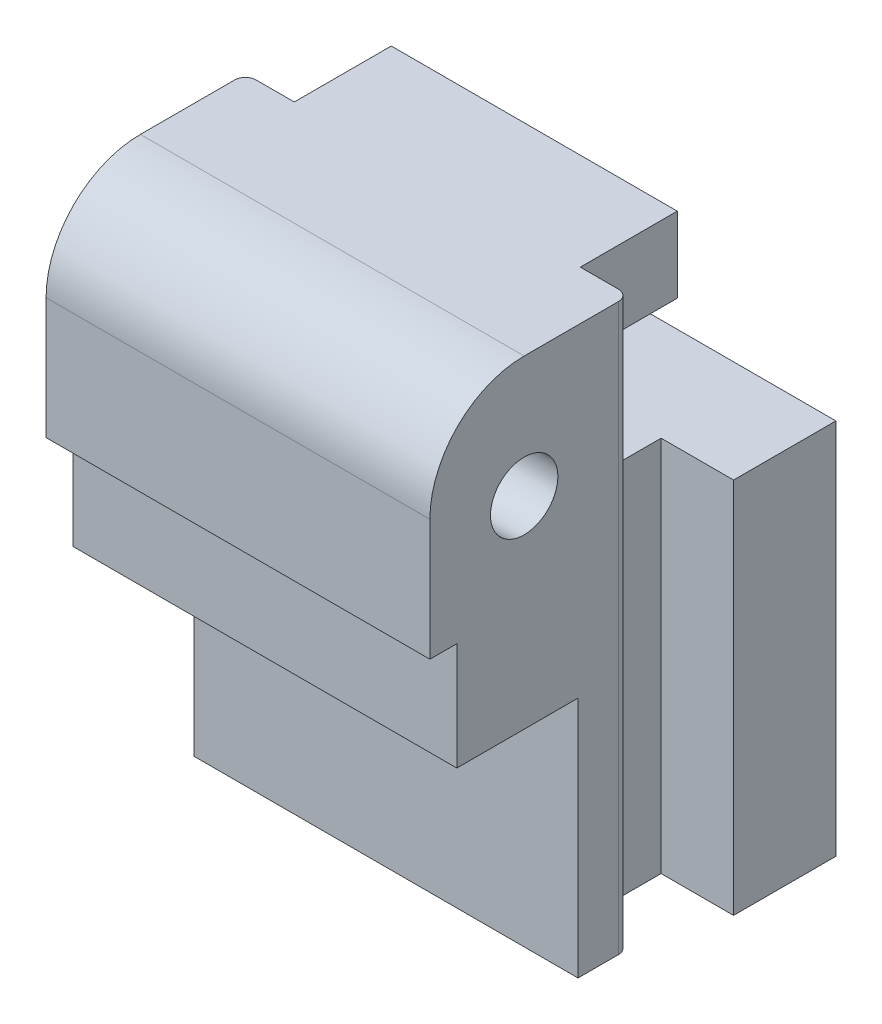
ISO-10303-21;
HEADER;
FILE_DESCRIPTION(('STEP AP214'),'2;1');
FILE_NAME('part.step','',(''),(''),'','','');
FILE_SCHEMA(('AUTOMOTIVE_DESIGN { 1 0 10303 214 1 1 1 1 }'));
ENDSEC;
DATA;
#1=APPLICATION_CONTEXT('core data for automotive mechanical design processes');
#2=APPLICATION_PROTOCOL_DEFINITION('international standard','automotive_design',2000,#1);
#3=PRODUCT_CONTEXT('',#1,'mechanical');
#4=PRODUCT('Part','Part','',(#3));
#5=PRODUCT_RELATED_PRODUCT_CATEGORY('part','',(#4));
#6=PRODUCT_DEFINITION_FORMATION('','',#4);
#7=PRODUCT_DEFINITION_CONTEXT('part definition',#1,'design');
#8=PRODUCT_DEFINITION('design','',#6,#7);
#9=PRODUCT_DEFINITION_SHAPE('','',#8);
#10=(LENGTH_UNIT() NAMED_UNIT(*) SI_UNIT(.MILLI.,.METRE.));
#11=(NAMED_UNIT(*) PLANE_ANGLE_UNIT() SI_UNIT($,.RADIAN.));
#12=(NAMED_UNIT(*) SI_UNIT($,.STERADIAN.) SOLID_ANGLE_UNIT());
#13=UNCERTAINTY_MEASURE_WITH_UNIT(LENGTH_MEASURE(1.E-05),#10,'distance_accuracy_value','');
#14=(GEOMETRIC_REPRESENTATION_CONTEXT(3) GLOBAL_UNCERTAINTY_ASSIGNED_CONTEXT((#13)) GLOBAL_UNIT_ASSIGNED_CONTEXT((#10,
#11,#12)) REPRESENTATION_CONTEXT('',''));
#15=CARTESIAN_POINT('',(0.,0.,0.));
#16=DIRECTION('',(0.,0.,1.));
#17=DIRECTION('',(1.,0.,0.));
#18=AXIS2_PLACEMENT_3D('',#15,#16,#17);
#19=CARTESIAN_POINT('',(8.,13.,14.2));
#20=DIRECTION('',(0.,1.,0.));
#21=DIRECTION('',(0.,0.,1.));
#22=AXIS2_PLACEMENT_3D('',#19,#20,#21);
#23=PLANE('',#22);
#24=DIRECTION('',(-1.,0.,0.));
#25=VECTOR('',#24,1.);
#26=CARTESIAN_POINT('',(8.,13.,13.2));
#27=LINE('',#26,#25);
#28=CARTESIAN_POINT('',(-7.125,13.,13.2));
#29=VERTEX_POINT('',#28);
#30=CARTESIAN_POINT('',(7.125,13.,13.2));
#31=VERTEX_POINT('',#30);
#32=EDGE_CURVE('E286',#29,#31,#27,.F.);
#33=ORIENTED_EDGE('',*,*,#32,.T.);
#34=DIRECTION('',(0.,0.,1.));
#35=VECTOR('',#34,1.);
#36=CARTESIAN_POINT('',(7.125,13.,14.2));
#37=LINE('',#36,#35);
#38=CARTESIAN_POINT('',(7.125,13.,14.2));
#39=VERTEX_POINT('',#38);
#40=EDGE_CURVE('E310',#39,#31,#37,.F.);
#41=ORIENTED_EDGE('',*,*,#40,.F.);
#42=DIRECTION('',(-1.,0.,0.));
#43=VECTOR('',#42,1.);
#44=CARTESIAN_POINT('',(8.,13.,14.2));
#45=LINE('',#44,#43);
#46=CARTESIAN_POINT('',(-7.125,13.,14.2));
#47=VERTEX_POINT('',#46);
#48=EDGE_CURVE('E179',#39,#47,#45,.T.);
#49=ORIENTED_EDGE('',*,*,#48,.T.);
#50=DIRECTION('',(0.,0.,1.));
#51=VECTOR('',#50,1.);
#52=CARTESIAN_POINT('',(-7.125,13.,14.2));
#53=LINE('',#52,#51);
#54=EDGE_CURVE('E312',#29,#47,#53,.T.);
#55=ORIENTED_EDGE('',*,*,#54,.F.);
#56=EDGE_LOOP('',(#33,#41,#49,#55));
#57=FACE_BOUND('',#56,.T.);
#58=ADVANCED_FACE('F17',(#57),#23,.F.);
#59=CARTESIAN_POINT('',(8.,16.5,10.7));
#60=DIRECTION('',(-1.,0.,0.));
#61=DIRECTION('',(0.,0.,1.));
#62=AXIS2_PLACEMENT_3D('',#59,#60,#61);
#63=CYLINDRICAL_SURFACE('',#62,1.25);
#64=CARTESIAN_POINT('',(-7.125,16.5,10.7));
#65=DIRECTION('',(-1.,0.,0.));
#66=DIRECTION('',(0.,0.,1.));
#67=AXIS2_PLACEMENT_3D('',#64,#65,#66);
#68=CIRCLE('',#67,1.25);
#69=CARTESIAN_POINT('',(-7.125,16.5,11.95));
#70=VERTEX_POINT('',#69);
#71=EDGE_CURVE('E245',#70,#70,#68,.F.);
#72=ORIENTED_EDGE('',*,*,#71,.F.);
#73=EDGE_LOOP('',(#72));
#74=FACE_BOUND('',#73,.T.);
#75=CARTESIAN_POINT('',(7.125,16.5,10.7));
#76=DIRECTION('',(-1.,0.,0.));
#77=DIRECTION('',(0.,0.,1.));
#78=AXIS2_PLACEMENT_3D('',#75,#76,#77);
#79=CIRCLE('',#78,1.25);
#80=CARTESIAN_POINT('',(7.125,16.5,11.95));
#81=VERTEX_POINT('',#80);
#82=EDGE_CURVE('E226',#81,#81,#79,.F.);
#83=ORIENTED_EDGE('',*,*,#82,.T.);
#84=EDGE_LOOP('',(#83));
#85=FACE_BOUND('',#84,.T.);
#86=ADVANCED_FACE('F422',(#74,#85),#63,.F.);
#87=CARTESIAN_POINT('',(8.,13.,13.2));
#88=DIRECTION('',(0.,0.,-1.));
#89=DIRECTION('',(-1.,0.,0.));
#90=AXIS2_PLACEMENT_3D('',#87,#88,#89);
#91=PLANE('',#90);
#92=DIRECTION('',(1.,0.,0.));
#93=VECTOR('',#92,1.);
#94=CARTESIAN_POINT('',(8.,9.,13.2));
#95=LINE('',#94,#93);
#96=CARTESIAN_POINT('',(-7.125,9.,13.2));
#97=VERTEX_POINT('',#96);
#98=CARTESIAN_POINT('',(7.125,9.,13.2));
#99=VERTEX_POINT('',#98);
#100=EDGE_CURVE('E227',#97,#99,#95,.T.);
#101=ORIENTED_EDGE('',*,*,#100,.T.);
#102=DIRECTION('',(0.,1.,0.));
#103=VECTOR('',#102,1.);
#104=CARTESIAN_POINT('',(7.125,21.,13.2));
#105=LINE('',#104,#103);
#106=EDGE_CURVE('E220',#99,#31,#105,.T.);
#107=ORIENTED_EDGE('',*,*,#106,.T.);
#108=ORIENTED_EDGE('',*,*,#32,.F.);
#109=DIRECTION('',(0.,1.,0.));
#110=VECTOR('',#109,1.);
#111=CARTESIAN_POINT('',(-7.125,21.,13.2));
#112=LINE('',#111,#110);
#113=EDGE_CURVE('E210',#97,#29,#112,.T.);
#114=ORIENTED_EDGE('',*,*,#113,.F.);
#115=EDGE_LOOP('',(#101,#107,#108,#114));
#116=FACE_BOUND('',#115,.T.);
#117=ADVANCED_FACE('F420',(#116),#91,.F.);
#118=CARTESIAN_POINT('',(8.,17.5,14.2));
#119=DIRECTION('',(0.,0.,-1.));
#120=DIRECTION('',(-1.,0.,0.));
#121=AXIS2_PLACEMENT_3D('',#118,#119,#120);
#122=PLANE('',#121);
#123=ORIENTED_EDGE('',*,*,#48,.F.);
#124=DIRECTION('',(0.,1.,0.));
#125=VECTOR('',#124,1.);
#126=CARTESIAN_POINT('',(7.125,21.,14.2));
#127=LINE('',#126,#125);
#128=CARTESIAN_POINT('',(7.125,17.5,14.2));
#129=VERTEX_POINT('',#128);
#130=EDGE_CURVE('E217',#39,#129,#127,.T.);
#131=ORIENTED_EDGE('',*,*,#130,.T.);
#132=DIRECTION('',(-1.,0.,0.));
#133=VECTOR('',#132,1.);
#134=CARTESIAN_POINT('',(8.,17.5,14.2));
#135=LINE('',#134,#133);
#136=CARTESIAN_POINT('',(-7.125,17.5,14.2));
#137=VERTEX_POINT('',#136);
#138=EDGE_CURVE('E229',#137,#129,#135,.F.);
#139=ORIENTED_EDGE('',*,*,#138,.F.);
#140=DIRECTION('',(0.,1.,0.));
#141=VECTOR('',#140,1.);
#142=CARTESIAN_POINT('',(-7.125,21.,14.2));
#143=LINE('',#142,#141);
#144=EDGE_CURVE('E207',#47,#137,#143,.T.);
#145=ORIENTED_EDGE('',*,*,#144,.F.);
#146=EDGE_LOOP('',(#123,#131,#139,#145));
#147=FACE_BOUND('',#146,.T.);
#148=ADVANCED_FACE('F404',(#147),#122,.F.);
#149=CARTESIAN_POINT('',(6.725,21.,7.2));
#150=DIRECTION('',(0.,-1.,0.));
#151=DIRECTION('',(0.,0.,-1.));
#152=AXIS2_PLACEMENT_3D('',#149,#150,#151);
#153=CYLINDRICAL_SURFACE('',#152,0.4);
#154=CARTESIAN_POINT('',(6.725,0.,7.2));
#155=DIRECTION('',(0.,-1.,0.));
#156=DIRECTION('',(0.,0.,-1.));
#157=AXIS2_PLACEMENT_3D('',#154,#155,#156);
#158=CIRCLE('',#157,0.4);
#159=CARTESIAN_POINT('',(7.125,0.,7.2));
#160=VERTEX_POINT('',#159);
#161=CARTESIAN_POINT('',(6.725,0.,6.8));
#162=VERTEX_POINT('',#161);
#163=EDGE_CURVE('E178',#160,#162,#158,.F.);
#164=ORIENTED_EDGE('',*,*,#163,.T.);
#165=DIRECTION('',(0.,1.,0.));
#166=VECTOR('',#165,1.);
#167=CARTESIAN_POINT('',(6.725,21.,6.8));
#168=LINE('',#167,#166);
#169=CARTESIAN_POINT('',(6.725,21.,6.8));
#170=VERTEX_POINT('',#169);
#171=EDGE_CURVE('E176',#162,#170,#168,.T.);
#172=ORIENTED_EDGE('',*,*,#171,.T.);
#173=CARTESIAN_POINT('',(6.725,21.,7.2));
#174=DIRECTION('',(0.,-1.,0.));
#175=DIRECTION('',(0.,0.,-1.));
#176=AXIS2_PLACEMENT_3D('',#173,#174,#175);
#177=CIRCLE('',#176,0.4);
#178=CARTESIAN_POINT('',(7.125,21.,7.2));
#179=VERTEX_POINT('',#178);
#180=EDGE_CURVE('E20',#170,#179,#177,.T.);
#181=ORIENTED_EDGE('',*,*,#180,.T.);
#182=DIRECTION('',(0.,1.,0.));
#183=VECTOR('',#182,1.);
#184=CARTESIAN_POINT('',(7.125,21.,7.2));
#185=LINE('',#184,#183);
#186=EDGE_CURVE('E174',#179,#160,#185,.F.);
#187=ORIENTED_EDGE('',*,*,#186,.T.);
#188=EDGE_LOOP('',(#164,#172,#181,#187));
#189=FACE_BOUND('',#188,.T.);
#190=ADVANCED_FACE('F173',(#189),#153,.T.);
#191=CARTESIAN_POINT('',(-6.725,21.,7.2));
#192=DIRECTION('',(0.,-1.,0.));
#193=DIRECTION('',(0.,0.,-1.));
#194=AXIS2_PLACEMENT_3D('',#191,#192,#193);
#195=CYLINDRICAL_SURFACE('',#194,0.4);
#196=CARTESIAN_POINT('',(-6.725,0.,7.2));
#197=DIRECTION('',(0.,-1.,0.));
#198=DIRECTION('',(0.,0.,-1.));
#199=AXIS2_PLACEMENT_3D('',#196,#197,#198);
#200=CIRCLE('',#199,0.4);
#201=CARTESIAN_POINT('',(-6.725,0.,6.8));
#202=VERTEX_POINT('',#201);
#203=CARTESIAN_POINT('',(-7.125,0.,7.2));
#204=VERTEX_POINT('',#203);
#205=EDGE_CURVE('E283',#202,#204,#200,.F.);
#206=ORIENTED_EDGE('',*,*,#205,.T.);
#207=DIRECTION('',(0.,1.,0.));
#208=VECTOR('',#207,1.);
#209=CARTESIAN_POINT('',(-7.125,21.,7.2));
#210=LINE('',#209,#208);
#211=CARTESIAN_POINT('',(-7.125,21.,7.2));
#212=VERTEX_POINT('',#211);
#213=EDGE_CURVE('E243',#212,#204,#210,.F.);
#214=ORIENTED_EDGE('',*,*,#213,.F.);
#215=CARTESIAN_POINT('',(-6.725,21.,7.2));
#216=DIRECTION('',(0.,-1.,0.));
#217=DIRECTION('',(0.,0.,-1.));
#218=AXIS2_PLACEMENT_3D('',#215,#216,#217);
#219=CIRCLE('',#218,0.4);
#220=CARTESIAN_POINT('',(-6.725,21.,6.8));
#221=VERTEX_POINT('',#220);
#222=EDGE_CURVE('E337',#212,#221,#219,.T.);
#223=ORIENTED_EDGE('',*,*,#222,.T.);
#224=DIRECTION('',(0.,1.,0.));
#225=VECTOR('',#224,1.);
#226=CARTESIAN_POINT('',(-6.725,21.,6.8));
#227=LINE('',#226,#225);
#228=EDGE_CURVE('E200',#202,#221,#227,.T.);
#229=ORIENTED_EDGE('',*,*,#228,.F.);
#230=EDGE_LOOP('',(#206,#214,#223,#229));
#231=FACE_BOUND('',#230,.T.);
#232=ADVANCED_FACE('F492',(#231),#195,.T.);
#233=CARTESIAN_POINT('',(8.,17.5,10.7));
#234=DIRECTION('',(-1.,0.,0.));
#235=DIRECTION('',(0.,0.,1.));
#236=AXIS2_PLACEMENT_3D('',#233,#234,#235);
#237=CYLINDRICAL_SURFACE('',#236,3.5);
#238=CARTESIAN_POINT('',(7.125,17.5,10.7));
#239=DIRECTION('',(-1.,0.,0.));
#240=DIRECTION('',(0.,0.,1.));
#241=AXIS2_PLACEMENT_3D('',#238,#239,#240);
#242=CIRCLE('',#241,3.5);
#243=CARTESIAN_POINT('',(7.125,21.,10.7));
#244=VERTEX_POINT('',#243);
#245=EDGE_CURVE('E189',#129,#244,#242,.T.);
#246=ORIENTED_EDGE('',*,*,#245,.T.);
#247=DIRECTION('',(1.,0.,0.));
#248=VECTOR('',#247,1.);
#249=CARTESIAN_POINT('',(8.,21.,10.7));
#250=LINE('',#249,#248);
#251=CARTESIAN_POINT('',(-7.125,21.,10.7));
#252=VERTEX_POINT('',#251);
#253=EDGE_CURVE('E195',#244,#252,#250,.F.);
#254=ORIENTED_EDGE('',*,*,#253,.T.);
#255=CARTESIAN_POINT('',(-7.125,17.5,10.7));
#256=DIRECTION('',(-1.,0.,0.));
#257=DIRECTION('',(0.,0.,1.));
#258=AXIS2_PLACEMENT_3D('',#255,#256,#257);
#259=CIRCLE('',#258,3.5);
#260=EDGE_CURVE('E209',#137,#252,#259,.T.);
#261=ORIENTED_EDGE('',*,*,#260,.F.);
#262=ORIENTED_EDGE('',*,*,#138,.T.);
#263=EDGE_LOOP('',(#246,#254,#261,#262));
#264=FACE_BOUND('',#263,.T.);
#265=ADVANCED_FACE('F399',(#264),#237,.T.);
#266=CARTESIAN_POINT('',(8.,9.,13.2));
#267=DIRECTION('',(0.,1.,0.));
#268=DIRECTION('',(0.,0.,1.));
#269=AXIS2_PLACEMENT_3D('',#266,#267,#268);
#270=PLANE('',#269);
#271=DIRECTION('',(1.,0.,0.));
#272=VECTOR('',#271,1.);
#273=CARTESIAN_POINT('',(8.,9.,8.7));
#274=LINE('',#273,#272);
#275=CARTESIAN_POINT('',(-7.125,9.,8.7));
#276=VERTEX_POINT('',#275);
#277=CARTESIAN_POINT('',(7.125,9.,8.7));
#278=VERTEX_POINT('',#277);
#279=EDGE_CURVE('E307',#276,#278,#274,.T.);
#280=ORIENTED_EDGE('',*,*,#279,.T.);
#281=DIRECTION('',(0.,0.,1.));
#282=VECTOR('',#281,1.);
#283=CARTESIAN_POINT('',(7.125,9.,14.2));
#284=LINE('',#283,#282);
#285=EDGE_CURVE('E223',#278,#99,#284,.T.);
#286=ORIENTED_EDGE('',*,*,#285,.T.);
#287=ORIENTED_EDGE('',*,*,#100,.F.);
#288=DIRECTION('',(0.,0.,1.));
#289=VECTOR('',#288,1.);
#290=CARTESIAN_POINT('',(-7.125,9.,14.2));
#291=LINE('',#290,#289);
#292=EDGE_CURVE('E213',#276,#97,#291,.T.);
#293=ORIENTED_EDGE('',*,*,#292,.F.);
#294=EDGE_LOOP('',(#280,#286,#287,#293));
#295=FACE_BOUND('',#294,.T.);
#296=ADVANCED_FACE('F412',(#295),#270,.F.);
#297=CARTESIAN_POINT('',(7.125,21.,14.2));
#298=DIRECTION('',(-1.,0.,0.));
#299=DIRECTION('',(0.,0.,1.));
#300=AXIS2_PLACEMENT_3D('',#297,#298,#299);
#301=PLANE('',#300);
#302=ORIENTED_EDGE('',*,*,#186,.F.);
#303=DIRECTION('',(0.,0.,-1.));
#304=VECTOR('',#303,1.);
#305=CARTESIAN_POINT('',(7.125,21.,3.2));
#306=LINE('',#305,#304);
#307=EDGE_CURVE('E186',#179,#244,#306,.F.);
#308=ORIENTED_EDGE('',*,*,#307,.T.);
#309=ORIENTED_EDGE('',*,*,#245,.F.);
#310=ORIENTED_EDGE('',*,*,#130,.F.);
#311=ORIENTED_EDGE('',*,*,#40,.T.);
#312=ORIENTED_EDGE('',*,*,#106,.F.);
#313=ORIENTED_EDGE('',*,*,#285,.F.);
#314=DIRECTION('',(0.,1.,0.));
#315=VECTOR('',#314,1.);
#316=CARTESIAN_POINT('',(7.125,9.,8.7));
#317=LINE('',#316,#315);
#318=CARTESIAN_POINT('',(7.125,0.,8.7));
#319=VERTEX_POINT('',#318);
#320=EDGE_CURVE('E295',#278,#319,#317,.F.);
#321=ORIENTED_EDGE('',*,*,#320,.T.);
#322=DIRECTION('',(0.,0.,1.));
#323=VECTOR('',#322,1.);
#324=CARTESIAN_POINT('',(7.125,0.,14.2));
#325=LINE('',#324,#323);
#326=EDGE_CURVE('E188',#160,#319,#325,.T.);
#327=ORIENTED_EDGE('',*,*,#326,.F.);
#328=EDGE_LOOP('',(#302,#308,#309,#310,#311,#312,#313,#321,#327));
#329=FACE_BOUND('',#328,.T.);
#330=ORIENTED_EDGE('',*,*,#82,.F.);
#331=EDGE_LOOP('',(#330));
#332=FACE_BOUND('',#331,.T.);
#333=ADVANCED_FACE('F183',(#329,#332),#301,.F.);
#334=CARTESIAN_POINT('',(-7.125,21.,14.2));
#335=DIRECTION('',(-1.,0.,0.));
#336=DIRECTION('',(0.,0.,1.));
#337=AXIS2_PLACEMENT_3D('',#334,#335,#336);
#338=PLANE('',#337);
#339=ORIENTED_EDGE('',*,*,#144,.T.);
#340=ORIENTED_EDGE('',*,*,#260,.T.);
#341=DIRECTION('',(0.,0.,-1.));
#342=VECTOR('',#341,1.);
#343=CARTESIAN_POINT('',(-7.125,21.,3.2));
#344=LINE('',#343,#342);
#345=EDGE_CURVE('E198',#252,#212,#344,.T.);
#346=ORIENTED_EDGE('',*,*,#345,.T.);
#347=ORIENTED_EDGE('',*,*,#213,.T.);
#348=DIRECTION('',(0.,0.,1.));
#349=VECTOR('',#348,1.);
#350=CARTESIAN_POINT('',(-7.125,0.,14.2));
#351=LINE('',#350,#349);
#352=CARTESIAN_POINT('',(-7.125,0.,8.7));
#353=VERTEX_POINT('',#352);
#354=EDGE_CURVE('E216',#204,#353,#351,.T.);
#355=ORIENTED_EDGE('',*,*,#354,.T.);
#356=DIRECTION('',(0.,1.,0.));
#357=VECTOR('',#356,1.);
#358=CARTESIAN_POINT('',(-7.125,9.,8.7));
#359=LINE('',#358,#357);
#360=EDGE_CURVE('E292',#353,#276,#359,.T.);
#361=ORIENTED_EDGE('',*,*,#360,.T.);
#362=ORIENTED_EDGE('',*,*,#292,.T.);
#363=ORIENTED_EDGE('',*,*,#113,.T.);
#364=ORIENTED_EDGE('',*,*,#54,.T.);
#365=EDGE_LOOP('',(#339,#340,#346,#347,#355,#361,#362,#363,#364));
#366=FACE_BOUND('',#365,.T.);
#367=ORIENTED_EDGE('',*,*,#71,.T.);
#368=EDGE_LOOP('',(#367));
#369=FACE_BOUND('',#368,.T.);
#370=ADVANCED_FACE('F393',(#366,#369),#338,.T.);
#371=CARTESIAN_POINT('',(7.125,21.,6.8));
#372=DIRECTION('',(0.,0.,1.));
#373=DIRECTION('',(1.,0.,0.));
#374=AXIS2_PLACEMENT_3D('',#371,#372,#373);
#375=PLANE('',#374);
#376=ORIENTED_EDGE('',*,*,#171,.F.);
#377=DIRECTION('',(1.,0.,0.));
#378=VECTOR('',#377,1.);
#379=CARTESIAN_POINT('',(7.125,0.,6.8));
#380=LINE('',#379,#378);
#381=CARTESIAN_POINT('',(5.31,0.,6.8));
#382=VERTEX_POINT('',#381);
#383=EDGE_CURVE('E248',#382,#162,#380,.T.);
#384=ORIENTED_EDGE('',*,*,#383,.F.);
#385=DIRECTION('',(0.,1.,0.));
#386=VECTOR('',#385,1.);
#387=CARTESIAN_POINT('',(5.31,21.,6.8));
#388=LINE('',#387,#386);
#389=CARTESIAN_POINT('',(5.31,21.,6.8));
#390=VERTEX_POINT('',#389);
#391=EDGE_CURVE('E253',#382,#390,#388,.T.);
#392=ORIENTED_EDGE('',*,*,#391,.T.);
#393=DIRECTION('',(1.,0.,0.));
#394=VECTOR('',#393,1.);
#395=CARTESIAN_POINT('',(8.,21.,6.8));
#396=LINE('',#395,#394);
#397=EDGE_CURVE('E196',#390,#170,#396,.T.);
#398=ORIENTED_EDGE('',*,*,#397,.T.);
#399=EDGE_LOOP('',(#376,#384,#392,#398));
#400=FACE_BOUND('',#399,.T.);
#401=ADVANCED_FACE('F340',(#400),#375,.F.);
#402=CARTESIAN_POINT('',(-7.125,21.,6.8));
#403=DIRECTION('',(0.,0.,-1.));
#404=DIRECTION('',(-1.,0.,0.));
#405=AXIS2_PLACEMENT_3D('',#402,#403,#404);
#406=PLANE('',#405);
#407=DIRECTION('',(1.,0.,0.));
#408=VECTOR('',#407,1.);
#409=CARTESIAN_POINT('',(8.,21.,6.8));
#410=LINE('',#409,#408);
#411=CARTESIAN_POINT('',(-5.31,21.,6.8));
#412=VERTEX_POINT('',#411);
#413=EDGE_CURVE('E363',#221,#412,#410,.T.);
#414=ORIENTED_EDGE('',*,*,#413,.T.);
#415=DIRECTION('',(0.,1.,0.));
#416=VECTOR('',#415,1.);
#417=CARTESIAN_POINT('',(-5.31,21.,6.8));
#418=LINE('',#417,#416);
#419=CARTESIAN_POINT('',(-5.31,0.,6.8));
#420=VERTEX_POINT('',#419);
#421=EDGE_CURVE('E233',#420,#412,#418,.T.);
#422=ORIENTED_EDGE('',*,*,#421,.F.);
#423=DIRECTION('',(-1.,0.,0.));
#424=VECTOR('',#423,1.);
#425=CARTESIAN_POINT('',(-7.125,0.,6.8));
#426=LINE('',#425,#424);
#427=EDGE_CURVE('E232',#420,#202,#426,.T.);
#428=ORIENTED_EDGE('',*,*,#427,.T.);
#429=ORIENTED_EDGE('',*,*,#228,.T.);
#430=EDGE_LOOP('',(#414,#422,#428,#429));
#431=FACE_BOUND('',#430,.T.);
#432=ADVANCED_FACE('F479',(#431),#406,.T.);
#433=CARTESIAN_POINT('',(8.,21.,3.2));
#434=DIRECTION('',(0.,-1.,0.));
#435=DIRECTION('',(0.,0.,-1.));
#436=AXIS2_PLACEMENT_3D('',#433,#434,#435);
#437=PLANE('',#436);
#438=ORIENTED_EDGE('',*,*,#222,.F.);
#439=ORIENTED_EDGE('',*,*,#345,.F.);
#440=ORIENTED_EDGE('',*,*,#253,.F.);
#441=ORIENTED_EDGE('',*,*,#307,.F.);
#442=ORIENTED_EDGE('',*,*,#180,.F.);
#443=ORIENTED_EDGE('',*,*,#397,.F.);
#444=DIRECTION('',(0.,0.,1.));
#445=VECTOR('',#444,1.);
#446=CARTESIAN_POINT('',(5.31,21.,6.8));
#447=LINE('',#446,#445);
#448=CARTESIAN_POINT('',(5.31,21.,3.2));
#449=VERTEX_POINT('',#448);
#450=EDGE_CURVE('E249',#390,#449,#447,.F.);
#451=ORIENTED_EDGE('',*,*,#450,.T.);
#452=DIRECTION('',(1.,0.,0.));
#453=VECTOR('',#452,1.);
#454=CARTESIAN_POINT('',(8.,21.,3.2));
#455=LINE('',#454,#453);
#456=CARTESIAN_POINT('',(-5.31,21.,3.2));
#457=VERTEX_POINT('',#456);
#458=EDGE_CURVE('E358',#449,#457,#455,.F.);
#459=ORIENTED_EDGE('',*,*,#458,.T.);
#460=DIRECTION('',(0.,0.,1.));
#461=VECTOR('',#460,1.);
#462=CARTESIAN_POINT('',(-5.31,21.,6.8));
#463=LINE('',#462,#461);
#464=EDGE_CURVE('E235',#412,#457,#463,.F.);
#465=ORIENTED_EDGE('',*,*,#464,.F.);
#466=ORIENTED_EDGE('',*,*,#413,.F.);
#467=EDGE_LOOP('',(#438,#439,#440,#441,#442,#443,#451,#459,#465,#466));
#468=FACE_BOUND('',#467,.T.);
#469=ADVANCED_FACE('F192',(#468),#437,.F.);
#470=CARTESIAN_POINT('',(8.,18.2,3.2));
#471=DIRECTION('',(0.,0.,1.));
#472=DIRECTION('',(1.,0.,0.));
#473=AXIS2_PLACEMENT_3D('',#470,#471,#472);
#474=PLANE('',#473);
#475=ORIENTED_EDGE('',*,*,#458,.F.);
#476=DIRECTION('',(0.,1.,0.));
#477=VECTOR('',#476,1.);
#478=CARTESIAN_POINT('',(5.31,21.,3.2));
#479=LINE('',#478,#477);
#480=CARTESIAN_POINT('',(5.31,18.2,3.2));
#481=VERTEX_POINT('',#480);
#482=EDGE_CURVE('E252',#449,#481,#479,.F.);
#483=ORIENTED_EDGE('',*,*,#482,.T.);
#484=DIRECTION('',(1.,0.,0.));
#485=VECTOR('',#484,1.);
#486=CARTESIAN_POINT('',(8.,18.2,3.2));
#487=LINE('',#486,#485);
#488=CARTESIAN_POINT('',(-5.31,18.2,3.2));
#489=VERTEX_POINT('',#488);
#490=EDGE_CURVE('E362',#481,#489,#487,.F.);
#491=ORIENTED_EDGE('',*,*,#490,.T.);
#492=DIRECTION('',(0.,1.,0.));
#493=VECTOR('',#492,1.);
#494=CARTESIAN_POINT('',(-5.31,21.,3.2));
#495=LINE('',#494,#493);
#496=EDGE_CURVE('E240',#457,#489,#495,.F.);
#497=ORIENTED_EDGE('',*,*,#496,.F.);
#498=EDGE_LOOP('',(#475,#483,#491,#497));
#499=FACE_BOUND('',#498,.T.);
#500=ADVANCED_FACE('F366',(#499),#474,.F.);
#501=CARTESIAN_POINT('',(8.,18.2,6.2));
#502=DIRECTION('',(0.,1.,0.));
#503=DIRECTION('',(0.,0.,1.));
#504=AXIS2_PLACEMENT_3D('',#501,#502,#503);
#505=PLANE('',#504);
#506=ORIENTED_EDGE('',*,*,#490,.F.);
#507=DIRECTION('',(0.,0.,1.));
#508=VECTOR('',#507,1.);
#509=CARTESIAN_POINT('',(5.31,18.2,6.8));
#510=LINE('',#509,#508);
#511=CARTESIAN_POINT('',(5.31,18.2,6.2));
#512=VERTEX_POINT('',#511);
#513=EDGE_CURVE('E380',#481,#512,#510,.T.);
#514=ORIENTED_EDGE('',*,*,#513,.T.);
#515=DIRECTION('',(1.,0.,0.));
#516=VECTOR('',#515,1.);
#517=CARTESIAN_POINT('',(8.,18.2,6.2));
#518=LINE('',#517,#516);
#519=CARTESIAN_POINT('',(-5.31,18.2,6.2));
#520=VERTEX_POINT('',#519);
#521=EDGE_CURVE('E236',#512,#520,#518,.F.);
#522=ORIENTED_EDGE('',*,*,#521,.T.);
#523=DIRECTION('',(0.,0.,1.));
#524=VECTOR('',#523,1.);
#525=CARTESIAN_POINT('',(-5.31,18.2,6.8));
#526=LINE('',#525,#524);
#527=EDGE_CURVE('E369',#489,#520,#526,.T.);
#528=ORIENTED_EDGE('',*,*,#527,.F.);
#529=EDGE_LOOP('',(#506,#514,#522,#528));
#530=FACE_BOUND('',#529,.T.);
#531=ADVANCED_FACE('F471',(#530),#505,.F.);
#532=CARTESIAN_POINT('',(8.,9.,8.7));
#533=DIRECTION('',(0.,0.,-1.));
#534=DIRECTION('',(0.,1.,0.));
#535=AXIS2_PLACEMENT_3D('',#532,#533,#534);
#536=PLANE('',#535);
#537=DIRECTION('',(1.,0.,0.));
#538=VECTOR('',#537,1.);
#539=CARTESIAN_POINT('',(8.,0.,8.7));
#540=LINE('',#539,#538);
#541=EDGE_CURVE('E279',#353,#319,#540,.T.);
#542=ORIENTED_EDGE('',*,*,#541,.T.);
#543=ORIENTED_EDGE('',*,*,#320,.F.);
#544=ORIENTED_EDGE('',*,*,#279,.F.);
#545=ORIENTED_EDGE('',*,*,#360,.F.);
#546=EDGE_LOOP('',(#542,#543,#544,#545));
#547=FACE_BOUND('',#546,.T.);
#548=ADVANCED_FACE('F416',(#547),#536,.F.);
#549=CARTESIAN_POINT('',(5.31,21.,3.8));
#550=DIRECTION('',(0.,0.,-1.));
#551=DIRECTION('',(-1.,0.,0.));
#552=AXIS2_PLACEMENT_3D('',#549,#550,#551);
#553=PLANE('',#552);
#554=DIRECTION('',(1.,0.,0.));
#555=VECTOR('',#554,1.);
#556=CARTESIAN_POINT('',(8.,0.,3.8));
#557=LINE('',#556,#555);
#558=CARTESIAN_POINT('',(5.31,0.,3.8));
#559=VERTEX_POINT('',#558);
#560=CARTESIAN_POINT('',(8.,0.,3.8));
#561=VERTEX_POINT('',#560);
#562=EDGE_CURVE('E278',#559,#561,#557,.T.);
#563=ORIENTED_EDGE('',*,*,#562,.T.);
#564=DIRECTION('',(0.,1.,0.));
#565=VECTOR('',#564,1.);
#566=CARTESIAN_POINT('',(8.,17.5,3.8));
#567=LINE('',#566,#565);
#568=CARTESIAN_POINT('',(8.,14.,3.8));
#569=VERTEX_POINT('',#568);
#570=EDGE_CURVE('E267',#569,#561,#567,.F.);
#571=ORIENTED_EDGE('',*,*,#570,.F.);
#572=DIRECTION('',(1.,0.,0.));
#573=VECTOR('',#572,1.);
#574=CARTESIAN_POINT('',(8.,14.,3.8));
#575=LINE('',#574,#573);
#576=CARTESIAN_POINT('',(5.31,14.,3.8));
#577=VERTEX_POINT('',#576);
#578=EDGE_CURVE('E687',#569,#577,#575,.F.);
#579=ORIENTED_EDGE('',*,*,#578,.T.);
#580=DIRECTION('',(0.,1.,0.));
#581=VECTOR('',#580,1.);
#582=CARTESIAN_POINT('',(5.31,21.,3.8));
#583=LINE('',#582,#581);
#584=EDGE_CURVE('E258',#577,#559,#583,.F.);
#585=ORIENTED_EDGE('',*,*,#584,.T.);
#586=EDGE_LOOP('',(#563,#571,#579,#585));
#587=FACE_BOUND('',#586,.T.);
#588=ADVANCED_FACE('F465',(#587),#553,.F.);
#589=CARTESIAN_POINT('',(5.31,21.,6.8));
#590=DIRECTION('',(-1.,0.,0.));
#591=DIRECTION('',(0.,0.,1.));
#592=AXIS2_PLACEMENT_3D('',#589,#590,#591);
#593=PLANE('',#592);
#594=ORIENTED_EDGE('',*,*,#513,.F.);
#595=ORIENTED_EDGE('',*,*,#482,.F.);
#596=ORIENTED_EDGE('',*,*,#450,.F.);
#597=ORIENTED_EDGE('',*,*,#391,.F.);
#598=DIRECTION('',(0.,0.,1.));
#599=VECTOR('',#598,1.);
#600=CARTESIAN_POINT('',(5.31,0.,8.7));
#601=LINE('',#600,#599);
#602=EDGE_CURVE('E275',#382,#559,#601,.F.);
#603=ORIENTED_EDGE('',*,*,#602,.T.);
#604=ORIENTED_EDGE('',*,*,#584,.F.);
#605=DIRECTION('',(0.,0.,-1.));
#606=VECTOR('',#605,1.);
#607=CARTESIAN_POINT('',(5.31,14.,0.));
#608=LINE('',#607,#606);
#609=CARTESIAN_POINT('',(5.31,14.,6.2));
#610=VERTEX_POINT('',#609);
#611=EDGE_CURVE('E685',#577,#610,#608,.F.);
#612=ORIENTED_EDGE('',*,*,#611,.T.);
#613=DIRECTION('',(0.,1.,0.));
#614=VECTOR('',#613,1.);
#615=CARTESIAN_POINT('',(5.31,14.,6.2));
#616=LINE('',#615,#614);
#617=EDGE_CURVE('E377',#610,#512,#616,.T.);
#618=ORIENTED_EDGE('',*,*,#617,.T.);
#619=EDGE_LOOP('',(#594,#595,#596,#597,#603,#604,#612,#618));
#620=FACE_BOUND('',#619,.T.);
#621=ADVANCED_FACE('F350',(#620),#593,.F.);
#622=CARTESIAN_POINT('',(8.,14.,6.2));
#623=DIRECTION('',(0.,0.,1.));
#624=DIRECTION('',(1.,0.,0.));
#625=AXIS2_PLACEMENT_3D('',#622,#623,#624);
#626=PLANE('',#625);
#627=ORIENTED_EDGE('',*,*,#521,.F.);
#628=ORIENTED_EDGE('',*,*,#617,.F.);
#629=DIRECTION('',(1.,0.,0.));
#630=VECTOR('',#629,1.);
#631=CARTESIAN_POINT('',(8.,14.,6.2));
#632=LINE('',#631,#630);
#633=CARTESIAN_POINT('',(-5.31,14.,6.2));
#634=VERTEX_POINT('',#633);
#635=EDGE_CURVE('E681',#610,#634,#632,.F.);
#636=ORIENTED_EDGE('',*,*,#635,.T.);
#637=DIRECTION('',(0.,1.,0.));
#638=VECTOR('',#637,1.);
#639=CARTESIAN_POINT('',(-5.31,21.,6.2));
#640=LINE('',#639,#638);
#641=EDGE_CURVE('E371',#520,#634,#640,.F.);
#642=ORIENTED_EDGE('',*,*,#641,.F.);
#643=EDGE_LOOP('',(#627,#628,#636,#642));
#644=FACE_BOUND('',#643,.T.);
#645=ADVANCED_FACE('F459',(#644),#626,.F.);
#646=CARTESIAN_POINT('',(-5.31,21.,6.8));
#647=DIRECTION('',(-1.,0.,0.));
#648=DIRECTION('',(0.,0.,1.));
#649=AXIS2_PLACEMENT_3D('',#646,#647,#648);
#650=PLANE('',#649);
#651=ORIENTED_EDGE('',*,*,#527,.T.);
#652=ORIENTED_EDGE('',*,*,#641,.T.);
#653=DIRECTION('',(0.,0.,-1.));
#654=VECTOR('',#653,1.);
#655=CARTESIAN_POINT('',(-5.31,14.,0.));
#656=LINE('',#655,#654);
#657=CARTESIAN_POINT('',(-5.31,14.,3.8));
#658=VERTEX_POINT('',#657);
#659=EDGE_CURVE('E677',#634,#658,#656,.T.);
#660=ORIENTED_EDGE('',*,*,#659,.T.);
#661=DIRECTION('',(0.,1.,0.));
#662=VECTOR('',#661,1.);
#663=CARTESIAN_POINT('',(-5.31,21.,3.8));
#664=LINE('',#663,#662);
#665=CARTESIAN_POINT('',(-5.31,0.,3.8));
#666=VERTEX_POINT('',#665);
#667=EDGE_CURVE('E300',#666,#658,#664,.T.);
#668=ORIENTED_EDGE('',*,*,#667,.F.);
#669=DIRECTION('',(0.,0.,1.));
#670=VECTOR('',#669,1.);
#671=CARTESIAN_POINT('',(-5.31,0.,8.7));
#672=LINE('',#671,#670);
#673=EDGE_CURVE('E264',#666,#420,#672,.T.);
#674=ORIENTED_EDGE('',*,*,#673,.T.);
#675=ORIENTED_EDGE('',*,*,#421,.T.);
#676=ORIENTED_EDGE('',*,*,#464,.T.);
#677=ORIENTED_EDGE('',*,*,#496,.T.);
#678=EDGE_LOOP('',(#651,#652,#660,#668,#674,#675,#676,#677));
#679=FACE_BOUND('',#678,.T.);
#680=ADVANCED_FACE('F455',(#679),#650,.T.);
#681=CARTESIAN_POINT('',(-5.31,21.,3.8));
#682=DIRECTION('',(0.,0.,1.));
#683=DIRECTION('',(1.,0.,0.));
#684=AXIS2_PLACEMENT_3D('',#681,#682,#683);
#685=PLANE('',#684);
#686=DIRECTION('',(1.,0.,0.));
#687=VECTOR('',#686,1.);
#688=CARTESIAN_POINT('',(8.,0.,3.8));
#689=LINE('',#688,#687);
#690=CARTESIAN_POINT('',(-8.,0.,3.8));
#691=VERTEX_POINT('',#690);
#692=EDGE_CURVE('E268',#691,#666,#689,.T.);
#693=ORIENTED_EDGE('',*,*,#692,.T.);
#694=ORIENTED_EDGE('',*,*,#667,.T.);
#695=DIRECTION('',(1.,0.,0.));
#696=VECTOR('',#695,1.);
#697=CARTESIAN_POINT('',(8.,14.,3.8));
#698=LINE('',#697,#696);
#699=CARTESIAN_POINT('',(-8.,14.,3.8));
#700=VERTEX_POINT('',#699);
#701=EDGE_CURVE('E682',#658,#700,#698,.F.);
#702=ORIENTED_EDGE('',*,*,#701,.T.);
#703=DIRECTION('',(0.,1.,0.));
#704=VECTOR('',#703,1.);
#705=CARTESIAN_POINT('',(-8.,17.5,3.8));
#706=LINE('',#705,#704);
#707=EDGE_CURVE('E668',#700,#691,#706,.F.);
#708=ORIENTED_EDGE('',*,*,#707,.T.);
#709=EDGE_LOOP('',(#693,#694,#702,#708));
#710=FACE_BOUND('',#709,.T.);
#711=ADVANCED_FACE('F452',(#710),#685,.T.);
#712=CARTESIAN_POINT('',(8.,0.,8.7));
#713=DIRECTION('',(0.,1.,0.));
#714=DIRECTION('',(0.,0.,1.));
#715=AXIS2_PLACEMENT_3D('',#712,#713,#714);
#716=PLANE('',#715);
#717=ORIENTED_EDGE('',*,*,#205,.F.);
#718=ORIENTED_EDGE('',*,*,#427,.F.);
#719=ORIENTED_EDGE('',*,*,#673,.F.);
#720=ORIENTED_EDGE('',*,*,#692,.F.);
#721=DIRECTION('',(0.,0.,-1.));
#722=VECTOR('',#721,1.);
#723=CARTESIAN_POINT('',(-8.,0.,10.7));
#724=LINE('',#723,#722);
#725=CARTESIAN_POINT('',(-8.,0.,0.));
#726=VERTEX_POINT('',#725);
#727=EDGE_CURVE('E683',#691,#726,#724,.T.);
#728=ORIENTED_EDGE('',*,*,#727,.T.);
#729=DIRECTION('',(1.,0.,0.));
#730=VECTOR('',#729,1.);
#731=CARTESIAN_POINT('',(8.,0.,0.));
#732=LINE('',#731,#730);
#733=CARTESIAN_POINT('',(8.,0.,0.));
#734=VERTEX_POINT('',#733);
#735=EDGE_CURVE('E701',#726,#734,#732,.T.);
#736=ORIENTED_EDGE('',*,*,#735,.T.);
#737=DIRECTION('',(0.,0.,-1.));
#738=VECTOR('',#737,1.);
#739=CARTESIAN_POINT('',(8.,0.,10.7));
#740=LINE('',#739,#738);
#741=EDGE_CURVE('E696',#561,#734,#740,.T.);
#742=ORIENTED_EDGE('',*,*,#741,.F.);
#743=ORIENTED_EDGE('',*,*,#562,.F.);
#744=ORIENTED_EDGE('',*,*,#602,.F.);
#745=ORIENTED_EDGE('',*,*,#383,.T.);
#746=ORIENTED_EDGE('',*,*,#163,.F.);
#747=ORIENTED_EDGE('',*,*,#326,.T.);
#748=ORIENTED_EDGE('',*,*,#541,.F.);
#749=ORIENTED_EDGE('',*,*,#354,.F.);
#750=EDGE_LOOP('',(#717,#718,#719,#720,#728,#736,#742,#743,#744,#745,#746,#747,#748,#749));
#751=FACE_BOUND('',#750,.T.);
#752=ADVANCED_FACE('F344',(#751),#716,.F.);
#753=CARTESIAN_POINT('',(8.,17.5,10.7));
#754=DIRECTION('',(1.,0.,0.));
#755=DIRECTION('',(0.,0.,-1.));
#756=AXIS2_PLACEMENT_3D('',#753,#754,#755);
#757=PLANE('',#756);
#758=DIRECTION('',(0.,1.,0.));
#759=VECTOR('',#758,1.);
#760=CARTESIAN_POINT('',(8.,0.,0.));
#761=LINE('',#760,#759);
#762=CARTESIAN_POINT('',(8.,14.,0.));
#763=VERTEX_POINT('',#762);
#764=EDGE_CURVE('E702',#734,#763,#761,.T.);
#765=ORIENTED_EDGE('',*,*,#764,.T.);
#766=DIRECTION('',(0.,0.,-1.));
#767=VECTOR('',#766,1.);
#768=CARTESIAN_POINT('',(8.,14.,0.));
#769=LINE('',#768,#767);
#770=EDGE_CURVE('E693',#763,#569,#769,.F.);
#771=ORIENTED_EDGE('',*,*,#770,.T.);
#772=ORIENTED_EDGE('',*,*,#570,.T.);
#773=ORIENTED_EDGE('',*,*,#741,.T.);
#774=EDGE_LOOP('',(#765,#771,#772,#773));
#775=FACE_BOUND('',#774,.T.);
#776=ADVANCED_FACE('F445',(#775),#757,.T.);
#777=CARTESIAN_POINT('',(8.,14.,0.));
#778=DIRECTION('',(0.,-1.,0.));
#779=DIRECTION('',(0.,0.,-1.));
#780=AXIS2_PLACEMENT_3D('',#777,#778,#779);
#781=PLANE('',#780);
#782=ORIENTED_EDGE('',*,*,#635,.F.);
#783=ORIENTED_EDGE('',*,*,#611,.F.);
#784=ORIENTED_EDGE('',*,*,#578,.F.);
#785=ORIENTED_EDGE('',*,*,#770,.F.);
#786=DIRECTION('',(1.,0.,0.));
#787=VECTOR('',#786,1.);
#788=CARTESIAN_POINT('',(8.,14.,0.));
#789=LINE('',#788,#787);
#790=CARTESIAN_POINT('',(-8.,14.,0.));
#791=VERTEX_POINT('',#790);
#792=EDGE_CURVE('E26',#763,#791,#789,.F.);
#793=ORIENTED_EDGE('',*,*,#792,.T.);
#794=DIRECTION('',(0.,0.,-1.));
#795=VECTOR('',#794,1.);
#796=CARTESIAN_POINT('',(-8.,14.,10.7));
#797=LINE('',#796,#795);
#798=EDGE_CURVE('E34',#791,#700,#797,.F.);
#799=ORIENTED_EDGE('',*,*,#798,.T.);
#800=ORIENTED_EDGE('',*,*,#701,.F.);
#801=ORIENTED_EDGE('',*,*,#659,.F.);
#802=EDGE_LOOP('',(#782,#783,#784,#785,#793,#799,#800,#801));
#803=FACE_BOUND('',#802,.T.);
#804=ADVANCED_FACE('F439',(#803),#781,.F.);
#805=CARTESIAN_POINT('',(-8.,17.5,10.7));
#806=DIRECTION('',(1.,0.,0.));
#807=DIRECTION('',(0.,0.,-1.));
#808=AXIS2_PLACEMENT_3D('',#805,#806,#807);
#809=PLANE('',#808);
#810=ORIENTED_EDGE('',*,*,#798,.F.);
#811=DIRECTION('',(0.,1.,0.));
#812=VECTOR('',#811,1.);
#813=CARTESIAN_POINT('',(-8.,0.,0.));
#814=LINE('',#813,#812);
#815=EDGE_CURVE('E11',#791,#726,#814,.F.);
#816=ORIENTED_EDGE('',*,*,#815,.T.);
#817=ORIENTED_EDGE('',*,*,#727,.F.);
#818=ORIENTED_EDGE('',*,*,#707,.F.);
#819=EDGE_LOOP('',(#810,#816,#817,#818));
#820=FACE_BOUND('',#819,.T.);
#821=ADVANCED_FACE('F433',(#820),#809,.F.);
#822=CARTESIAN_POINT('',(8.,0.,0.));
#823=DIRECTION('',(0.,0.,1.));
#824=DIRECTION('',(1.,0.,0.));
#825=AXIS2_PLACEMENT_3D('',#822,#823,#824);
#826=PLANE('',#825);
#827=ORIENTED_EDGE('',*,*,#792,.F.);
#828=ORIENTED_EDGE('',*,*,#764,.F.);
#829=ORIENTED_EDGE('',*,*,#735,.F.);
#830=ORIENTED_EDGE('',*,*,#815,.F.);
#831=EDGE_LOOP('',(#827,#828,#829,#830));
#832=FACE_BOUND('',#831,.T.);
#833=ADVANCED_FACE('F431',(#832),#826,.F.);
#834=CLOSED_SHELL('',(#58,#86,#117,#148,#190,#232,#265,#296,#333,#370,#401,#432,#469,#500,#531,
#548,#588,#621,#645,#680,#711,#752,#776,#804,#821,#833));
#835=MANIFOLD_SOLID_BREP('B1',#834);
#836=ADVANCED_BREP_SHAPE_REPRESENTATION('',(#18,#835),#14);
#837=SHAPE_DEFINITION_REPRESENTATION(#9,#836);
ENDSEC;
END-ISO-10303-21;
